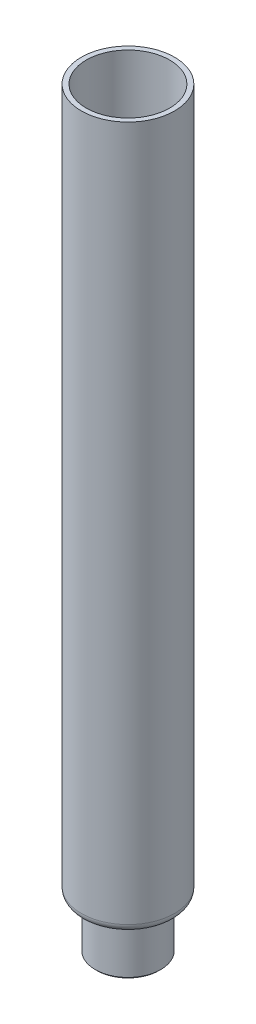
ISO-10303-21;
HEADER;
FILE_DESCRIPTION(('STEP AP214'),'2;1');
FILE_NAME('part.step','',(''),(''),'','','');
FILE_SCHEMA(('AUTOMOTIVE_DESIGN { 1 0 10303 214 1 1 1 1 }'));
ENDSEC;
DATA;
#1=APPLICATION_CONTEXT('core data for automotive mechanical design processes');
#2=APPLICATION_PROTOCOL_DEFINITION('international standard','automotive_design',2000,#1);
#3=PRODUCT_CONTEXT('',#1,'mechanical');
#4=PRODUCT('Part','Part','',(#3));
#5=PRODUCT_RELATED_PRODUCT_CATEGORY('part','',(#4));
#6=PRODUCT_DEFINITION_FORMATION('','',#4);
#7=PRODUCT_DEFINITION_CONTEXT('part definition',#1,'design');
#8=PRODUCT_DEFINITION('design','',#6,#7);
#9=PRODUCT_DEFINITION_SHAPE('','',#8);
#10=(LENGTH_UNIT() NAMED_UNIT(*) SI_UNIT(.MILLI.,.METRE.));
#11=(NAMED_UNIT(*) PLANE_ANGLE_UNIT() SI_UNIT($,.RADIAN.));
#12=(NAMED_UNIT(*) SI_UNIT($,.STERADIAN.) SOLID_ANGLE_UNIT());
#13=UNCERTAINTY_MEASURE_WITH_UNIT(LENGTH_MEASURE(1.E-05),#10,'distance_accuracy_value','');
#14=(GEOMETRIC_REPRESENTATION_CONTEXT(3) GLOBAL_UNCERTAINTY_ASSIGNED_CONTEXT((#13)) GLOBAL_UNIT_ASSIGNED_CONTEXT((#10,
#11,#12)) REPRESENTATION_CONTEXT('',''));
#15=CARTESIAN_POINT('',(0.,0.,0.));
#16=DIRECTION('',(0.,0.,1.));
#17=DIRECTION('',(1.,0.,0.));
#18=AXIS2_PLACEMENT_3D('',#15,#16,#17);
#19=CARTESIAN_POINT('',(8.50000000000001,-15.,0.));
#20=DIRECTION('',(0.,1.,0.));
#21=DIRECTION('',(0.,0.,1.));
#22=AXIS2_PLACEMENT_3D('',#19,#20,#21);
#23=PLANE('',#22);
#24=CARTESIAN_POINT('',(0.,-15.,0.));
#25=DIRECTION('',(0.,1.,0.));
#26=DIRECTION('',(0.,0.,1.));
#27=AXIS2_PLACEMENT_3D('',#24,#25,#26);
#28=CIRCLE('',#27,9.50000000000004);
#29=CARTESIAN_POINT('',(0.,-15.,9.50000000000004));
#30=VERTEX_POINT('',#29);
#31=EDGE_CURVE('E10',#30,#30,#28,.F.);
#32=ORIENTED_EDGE('',*,*,#31,.T.);
#33=EDGE_LOOP('',(#32));
#34=FACE_BOUND('',#33,.T.);
#35=CARTESIAN_POINT('',(0.,-15.,0.));
#36=DIRECTION('',(0.,1.,0.));
#37=DIRECTION('',(0.,0.,1.));
#38=AXIS2_PLACEMENT_3D('',#35,#36,#37);
#39=CIRCLE('',#38,8.50000000000001);
#40=CARTESIAN_POINT('',(0.,-15.,8.50000000000001));
#41=VERTEX_POINT('',#40);
#42=EDGE_CURVE('E34',#41,#41,#39,.T.);
#43=ORIENTED_EDGE('',*,*,#42,.T.);
#44=EDGE_LOOP('',(#43));
#45=FACE_BOUND('',#44,.T.);
#46=ADVANCED_FACE('F24',(#34,#45),#23,.F.);
#47=CARTESIAN_POINT('',(0.,34.9013031550069,0.));
#48=DIRECTION('',(0.,1.,0.));
#49=DIRECTION('',(0.,0.,1.));
#50=AXIS2_PLACEMENT_3D('',#47,#48,#49);
#51=CYLINDRICAL_SURFACE('',#50,8.50000000000001);
#52=ORIENTED_EDGE('',*,*,#42,.F.);
#53=EDGE_LOOP('',(#52));
#54=FACE_BOUND('',#53,.T.);
#55=CARTESIAN_POINT('',(0.,-1.,0.));
#56=DIRECTION('',(0.,1.,0.));
#57=DIRECTION('',(0.,0.,1.));
#58=AXIS2_PLACEMENT_3D('',#55,#56,#57);
#59=CIRCLE('',#58,8.50000000000001);
#60=CARTESIAN_POINT('',(0.,-1.,8.50000000000001));
#61=VERTEX_POINT('',#60);
#62=EDGE_CURVE('E38',#61,#61,#59,.T.);
#63=ORIENTED_EDGE('',*,*,#62,.T.);
#64=EDGE_LOOP('',(#63));
#65=FACE_BOUND('',#64,.T.);
#66=ADVANCED_FACE('F87',(#54,#65),#51,.F.);
#67=CARTESIAN_POINT('',(0.,-1.,0.));
#68=DIRECTION('',(0.,1.,0.));
#69=DIRECTION('',(0.,0.,1.));
#70=AXIS2_PLACEMENT_3D('',#67,#68,#69);
#71=TOROIDAL_SURFACE('',#70,11.,2.5);
#72=ORIENTED_EDGE('',*,*,#62,.F.);
#73=EDGE_LOOP('',(#72));
#74=FACE_BOUND('',#73,.T.);
#75=CARTESIAN_POINT('',(0.,1.5,0.));
#76=DIRECTION('',(0.,1.,0.));
#77=DIRECTION('',(0.,0.,1.));
#78=AXIS2_PLACEMENT_3D('',#75,#76,#77);
#79=CIRCLE('',#78,11.);
#80=CARTESIAN_POINT('',(0.,1.5,11.));
#81=VERTEX_POINT('',#80);
#82=EDGE_CURVE('E43',#81,#81,#79,.T.);
#83=ORIENTED_EDGE('',*,*,#82,.T.);
#84=EDGE_LOOP('',(#83));
#85=FACE_BOUND('',#84,.T.);
#86=ADVANCED_FACE('F91',(#74,#85),#71,.T.);
#87=CARTESIAN_POINT('',(11.,1.5,0.));
#88=DIRECTION('',(0.,-1.,0.));
#89=DIRECTION('',(0.,0.,-1.));
#90=AXIS2_PLACEMENT_3D('',#87,#88,#89);
#91=PLANE('',#90);
#92=ORIENTED_EDGE('',*,*,#82,.F.);
#93=EDGE_LOOP('',(#92));
#94=FACE_BOUND('',#93,.T.);
#95=CARTESIAN_POINT('',(0.,1.5,0.));
#96=DIRECTION('',(0.,1.,0.));
#97=DIRECTION('',(0.,0.,1.));
#98=AXIS2_PLACEMENT_3D('',#95,#96,#97);
#99=CIRCLE('',#98,11.75);
#100=CARTESIAN_POINT('',(0.,1.5,11.75));
#101=VERTEX_POINT('',#100);
#102=EDGE_CURVE('E46',#101,#101,#99,.T.);
#103=ORIENTED_EDGE('',*,*,#102,.T.);
#104=EDGE_LOOP('',(#103));
#105=FACE_BOUND('',#104,.T.);
#106=ADVANCED_FACE('F100',(#94,#105),#91,.F.);
#107=CARTESIAN_POINT('',(0.,2.5,0.));
#108=DIRECTION('',(0.,1.,0.));
#109=DIRECTION('',(0.,0.,1.));
#110=AXIS2_PLACEMENT_3D('',#107,#108,#109);
#111=TOROIDAL_SURFACE('',#110,11.75,1.);
#112=ORIENTED_EDGE('',*,*,#102,.F.);
#113=EDGE_LOOP('',(#112));
#114=FACE_BOUND('',#113,.T.);
#115=CARTESIAN_POINT('',(0.,2.5,0.));
#116=DIRECTION('',(0.,1.,0.));
#117=DIRECTION('',(0.,0.,1.));
#118=AXIS2_PLACEMENT_3D('',#115,#116,#117);
#119=CIRCLE('',#118,12.75);
#120=CARTESIAN_POINT('',(0.,2.5,12.75));
#121=VERTEX_POINT('',#120);
#122=EDGE_CURVE('E49',#121,#121,#119,.T.);
#123=ORIENTED_EDGE('',*,*,#122,.T.);
#124=EDGE_LOOP('',(#123));
#125=FACE_BOUND('',#124,.T.);
#126=ADVANCED_FACE('F106',(#114,#125),#111,.F.);
#127=CARTESIAN_POINT('',(0.,34.9013031550069,0.));
#128=DIRECTION('',(0.,1.,0.));
#129=DIRECTION('',(0.,0.,1.));
#130=AXIS2_PLACEMENT_3D('',#127,#128,#129);
#131=CYLINDRICAL_SURFACE('',#130,12.75);
#132=ORIENTED_EDGE('',*,*,#122,.F.);
#133=EDGE_LOOP('',(#132));
#134=FACE_BOUND('',#133,.T.);
#135=CARTESIAN_POINT('',(0.,215.,0.));
#136=DIRECTION('',(0.,1.,0.));
#137=DIRECTION('',(0.,0.,1.));
#138=AXIS2_PLACEMENT_3D('',#135,#136,#137);
#139=CIRCLE('',#138,12.75);
#140=CARTESIAN_POINT('',(0.,215.,12.75));
#141=VERTEX_POINT('',#140);
#142=EDGE_CURVE('E52',#141,#141,#139,.T.);
#143=ORIENTED_EDGE('',*,*,#142,.T.);
#144=EDGE_LOOP('',(#143));
#145=FACE_BOUND('',#144,.T.);
#146=ADVANCED_FACE('F112',(#134,#145),#131,.F.);
#147=CARTESIAN_POINT('',(12.75,215.,0.));
#148=DIRECTION('',(0.,-1.,0.));
#149=DIRECTION('',(0.,0.,-1.));
#150=AXIS2_PLACEMENT_3D('',#147,#148,#149);
#151=PLANE('',#150);
#152=ORIENTED_EDGE('',*,*,#142,.F.);
#153=EDGE_LOOP('',(#152));
#154=FACE_BOUND('',#153,.T.);
#155=CARTESIAN_POINT('',(0.,215.,0.));
#156=DIRECTION('',(0.,1.,0.));
#157=DIRECTION('',(0.,0.,1.));
#158=AXIS2_PLACEMENT_3D('',#155,#156,#157);
#159=CIRCLE('',#158,14.25);
#160=CARTESIAN_POINT('',(0.,215.,14.25));
#161=VERTEX_POINT('',#160);
#162=EDGE_CURVE('E55',#161,#161,#159,.T.);
#163=ORIENTED_EDGE('',*,*,#162,.T.);
#164=EDGE_LOOP('',(#163));
#165=FACE_BOUND('',#164,.T.);
#166=ADVANCED_FACE('F118',(#154,#165),#151,.F.);
#167=CARTESIAN_POINT('',(0.,34.9013031550069,0.));
#168=DIRECTION('',(0.,1.,0.));
#169=DIRECTION('',(0.,0.,1.));
#170=AXIS2_PLACEMENT_3D('',#167,#168,#169);
#171=CYLINDRICAL_SURFACE('',#170,14.25);
#172=ORIENTED_EDGE('',*,*,#162,.F.);
#173=EDGE_LOOP('',(#172));
#174=FACE_BOUND('',#173,.T.);
#175=CARTESIAN_POINT('',(0.,2.5,0.));
#176=DIRECTION('',(0.,1.,0.));
#177=DIRECTION('',(0.,0.,1.));
#178=AXIS2_PLACEMENT_3D('',#175,#176,#177);
#179=CIRCLE('',#178,14.25);
#180=CARTESIAN_POINT('',(0.,2.5,14.25));
#181=VERTEX_POINT('',#180);
#182=EDGE_CURVE('E58',#181,#181,#179,.T.);
#183=ORIENTED_EDGE('',*,*,#182,.T.);
#184=EDGE_LOOP('',(#183));
#185=FACE_BOUND('',#184,.T.);
#186=ADVANCED_FACE('F124',(#174,#185),#171,.T.);
#187=CARTESIAN_POINT('',(0.,2.5,0.));
#188=DIRECTION('',(0.,1.,0.));
#189=DIRECTION('',(0.,0.,1.));
#190=AXIS2_PLACEMENT_3D('',#187,#188,#189);
#191=TOROIDAL_SURFACE('',#190,11.75,2.5);
#192=ORIENTED_EDGE('',*,*,#182,.F.);
#193=EDGE_LOOP('',(#192));
#194=FACE_BOUND('',#193,.T.);
#195=CARTESIAN_POINT('',(0.,0.,0.));
#196=DIRECTION('',(0.,1.,0.));
#197=DIRECTION('',(0.,0.,1.));
#198=AXIS2_PLACEMENT_3D('',#195,#196,#197);
#199=CIRCLE('',#198,11.75);
#200=CARTESIAN_POINT('',(0.,0.,11.75));
#201=VERTEX_POINT('',#200);
#202=EDGE_CURVE('E61',#201,#201,#199,.T.);
#203=ORIENTED_EDGE('',*,*,#202,.T.);
#204=EDGE_LOOP('',(#203));
#205=FACE_BOUND('',#204,.T.);
#206=ADVANCED_FACE('F130',(#194,#205),#191,.T.);
#207=CARTESIAN_POINT('',(11.,0.,0.));
#208=DIRECTION('',(0.,1.,0.));
#209=DIRECTION('',(0.,0.,1.));
#210=AXIS2_PLACEMENT_3D('',#207,#208,#209);
#211=PLANE('',#210);
#212=ORIENTED_EDGE('',*,*,#202,.F.);
#213=EDGE_LOOP('',(#212));
#214=FACE_BOUND('',#213,.T.);
#215=CARTESIAN_POINT('',(0.,0.,0.));
#216=DIRECTION('',(0.,1.,0.));
#217=DIRECTION('',(0.,0.,1.));
#218=AXIS2_PLACEMENT_3D('',#215,#216,#217);
#219=CIRCLE('',#218,11.);
#220=CARTESIAN_POINT('',(0.,0.,11.));
#221=VERTEX_POINT('',#220);
#222=EDGE_CURVE('E64',#221,#221,#219,.T.);
#223=ORIENTED_EDGE('',*,*,#222,.T.);
#224=EDGE_LOOP('',(#223));
#225=FACE_BOUND('',#224,.T.);
#226=ADVANCED_FACE('F83',(#214,#225),#211,.F.);
#227=CARTESIAN_POINT('',(0.,-1.,0.));
#228=DIRECTION('',(0.,1.,0.));
#229=DIRECTION('',(0.,0.,1.));
#230=AXIS2_PLACEMENT_3D('',#227,#228,#229);
#231=TOROIDAL_SURFACE('',#230,11.,1.);
#232=ORIENTED_EDGE('',*,*,#222,.F.);
#233=EDGE_LOOP('',(#232));
#234=FACE_BOUND('',#233,.T.);
#235=CARTESIAN_POINT('',(0.,-1.,0.));
#236=DIRECTION('',(0.,1.,0.));
#237=DIRECTION('',(0.,0.,1.));
#238=AXIS2_PLACEMENT_3D('',#235,#236,#237);
#239=CIRCLE('',#238,10.);
#240=CARTESIAN_POINT('',(0.,-1.,10.));
#241=VERTEX_POINT('',#240);
#242=EDGE_CURVE('E67',#241,#241,#239,.T.);
#243=ORIENTED_EDGE('',*,*,#242,.T.);
#244=EDGE_LOOP('',(#243));
#245=FACE_BOUND('',#244,.T.);
#246=ADVANCED_FACE('F71',(#234,#245),#231,.F.);
#247=CARTESIAN_POINT('',(0.,34.9013031550069,0.));
#248=DIRECTION('',(0.,1.,0.));
#249=DIRECTION('',(0.,0.,1.));
#250=AXIS2_PLACEMENT_3D('',#247,#248,#249);
#251=CYLINDRICAL_SURFACE('',#250,10.);
#252=CARTESIAN_POINT('',(0.,-14.5,0.));
#253=DIRECTION('',(0.,1.,0.));
#254=DIRECTION('',(0.,0.,1.));
#255=AXIS2_PLACEMENT_3D('',#252,#253,#254);
#256=CIRCLE('',#255,10.);
#257=CARTESIAN_POINT('',(0.,-14.5,10.));
#258=VERTEX_POINT('',#257);
#259=EDGE_CURVE('E30',#258,#258,#256,.T.);
#260=ORIENTED_EDGE('',*,*,#259,.T.);
#261=EDGE_LOOP('',(#260));
#262=FACE_BOUND('',#261,.T.);
#263=ORIENTED_EDGE('',*,*,#242,.F.);
#264=EDGE_LOOP('',(#263));
#265=FACE_BOUND('',#264,.T.);
#266=ADVANCED_FACE('F73',(#262,#265),#251,.T.);
#267=CARTESIAN_POINT('',(0.,-14.5,0.));
#268=DIRECTION('',(0.,1.,0.));
#269=DIRECTION('',(0.,0.,1.));
#270=AXIS2_PLACEMENT_3D('',#267,#268,#269);
#271=CONICAL_SURFACE('',#270,10.,0.785398163397424);
#272=ORIENTED_EDGE('',*,*,#31,.F.);
#273=EDGE_LOOP('',(#272));
#274=FACE_BOUND('',#273,.T.);
#275=ORIENTED_EDGE('',*,*,#259,.F.);
#276=EDGE_LOOP('',(#275));
#277=FACE_BOUND('',#276,.T.);
#278=ADVANCED_FACE('F75',(#274,#277),#271,.T.);
#279=CLOSED_SHELL('',(#46,#66,#86,#106,#126,#146,#166,#186,#206,#226,#246,#266,#278));
#280=MANIFOLD_SOLID_BREP('B2',#279);
#281=ADVANCED_BREP_SHAPE_REPRESENTATION('',(#18,#280),#14);
#282=SHAPE_DEFINITION_REPRESENTATION(#9,#281);
ENDSEC;
END-ISO-10303-21;
